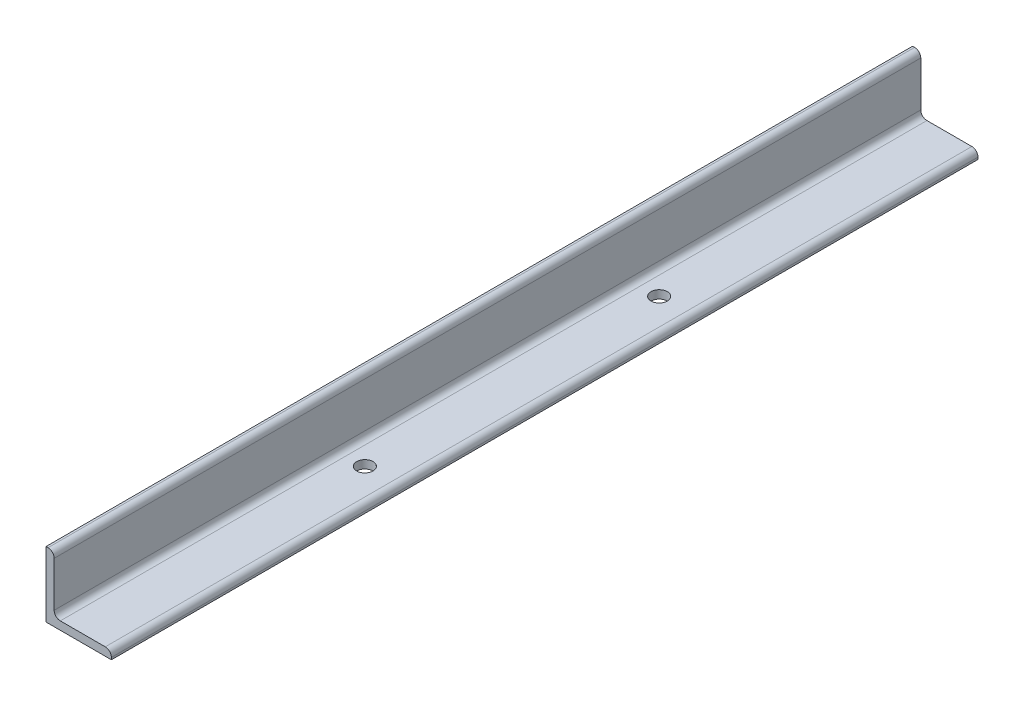
ISO-10303-21;
HEADER;
FILE_DESCRIPTION(('STEP AP214'),'2;1');
FILE_NAME('part.step','',(''),(''),'','','');
FILE_SCHEMA(('AUTOMOTIVE_DESIGN { 1 0 10303 214 1 1 1 1 }'));
ENDSEC;
DATA;
#1=APPLICATION_CONTEXT('core data for automotive mechanical design processes');
#2=APPLICATION_PROTOCOL_DEFINITION('international standard','automotive_design',2000,#1);
#3=PRODUCT_CONTEXT('',#1,'mechanical');
#4=PRODUCT('Part','Part','',(#3));
#5=PRODUCT_RELATED_PRODUCT_CATEGORY('part','',(#4));
#6=PRODUCT_DEFINITION_FORMATION('','',#4);
#7=PRODUCT_DEFINITION_CONTEXT('part definition',#1,'design');
#8=PRODUCT_DEFINITION('design','',#6,#7);
#9=PRODUCT_DEFINITION_SHAPE('','',#8);
#10=(LENGTH_UNIT() NAMED_UNIT(*) SI_UNIT(.MILLI.,.METRE.));
#11=(NAMED_UNIT(*) PLANE_ANGLE_UNIT() SI_UNIT($,.RADIAN.));
#12=(NAMED_UNIT(*) SI_UNIT($,.STERADIAN.) SOLID_ANGLE_UNIT());
#13=UNCERTAINTY_MEASURE_WITH_UNIT(LENGTH_MEASURE(1.E-05),#10,'distance_accuracy_value','');
#14=(GEOMETRIC_REPRESENTATION_CONTEXT(3) GLOBAL_UNCERTAINTY_ASSIGNED_CONTEXT((#13)) GLOBAL_UNIT_ASSIGNED_CONTEXT((#10,
#11,#12)) REPRESENTATION_CONTEXT('',''));
#15=CARTESIAN_POINT('',(0.,0.,0.));
#16=DIRECTION('',(0.,0.,1.));
#17=DIRECTION('',(1.,0.,0.));
#18=AXIS2_PLACEMENT_3D('',#15,#16,#17);
#19=CARTESIAN_POINT('',(50.7999999999999,0.,336.55));
#20=DIRECTION('',(0.,1.,0.));
#21=DIRECTION('',(0.,0.,1.));
#22=AXIS2_PLACEMENT_3D('',#19,#20,#21);
#23=PLANE('',#22);
#24=CARTESIAN_POINT('',(25.4,0.,114.3));
#25=DIRECTION('',(0.,-1.,0.));
#26=DIRECTION('',(0.,0.,-1.));
#27=AXIS2_PLACEMENT_3D('',#24,#25,#26);
#28=CIRCLE('',#27,6.35);
#29=CARTESIAN_POINT('',(25.4,0.,107.95));
#30=VERTEX_POINT('',#29);
#31=EDGE_CURVE('E178',#30,#30,#28,.T.);
#32=ORIENTED_EDGE('',*,*,#31,.F.);
#33=EDGE_LOOP('',(#32));
#34=FACE_BOUND('',#33,.T.);
#35=CARTESIAN_POINT('',(25.4,0.,-114.3));
#36=DIRECTION('',(0.,-1.,0.));
#37=DIRECTION('',(0.,0.,-1.));
#38=AXIS2_PLACEMENT_3D('',#35,#36,#37);
#39=CIRCLE('',#38,6.35);
#40=CARTESIAN_POINT('',(25.4,0.,-120.65));
#41=VERTEX_POINT('',#40);
#42=EDGE_CURVE('E170',#41,#41,#39,.T.);
#43=ORIENTED_EDGE('',*,*,#42,.F.);
#44=EDGE_LOOP('',(#43));
#45=FACE_BOUND('',#44,.T.);
#46=DIRECTION('',(1.,0.,0.));
#47=VECTOR('',#46,1.);
#48=CARTESIAN_POINT('',(50.7999999999999,0.,-336.55));
#49=LINE('',#48,#47);
#50=CARTESIAN_POINT('',(0.,0.,-336.55));
#51=VERTEX_POINT('',#50);
#52=CARTESIAN_POINT('',(50.7999999999999,0.,-336.55));
#53=VERTEX_POINT('',#52);
#54=EDGE_CURVE('E138',#51,#53,#49,.T.);
#55=ORIENTED_EDGE('',*,*,#54,.T.);
#56=DIRECTION('',(0.,0.,-1.));
#57=VECTOR('',#56,1.);
#58=CARTESIAN_POINT('',(50.7999999999999,0.,336.55));
#59=LINE('',#58,#57);
#60=CARTESIAN_POINT('',(50.7999999999999,0.,336.55));
#61=VERTEX_POINT('',#60);
#62=EDGE_CURVE('E11',#61,#53,#59,.T.);
#63=ORIENTED_EDGE('',*,*,#62,.F.);
#64=DIRECTION('',(1.,0.,0.));
#65=VECTOR('',#64,1.);
#66=CARTESIAN_POINT('',(50.7999999999999,0.,336.55));
#67=LINE('',#66,#65);
#68=CARTESIAN_POINT('',(0.,0.,336.55));
#69=VERTEX_POINT('',#68);
#70=EDGE_CURVE('E155',#69,#61,#67,.T.);
#71=ORIENTED_EDGE('',*,*,#70,.F.);
#72=DIRECTION('',(0.,0.,-1.));
#73=VECTOR('',#72,1.);
#74=CARTESIAN_POINT('',(0.,0.,336.55));
#75=LINE('',#74,#73);
#76=EDGE_CURVE('E134',#69,#51,#75,.T.);
#77=ORIENTED_EDGE('',*,*,#76,.T.);
#78=EDGE_LOOP('',(#55,#63,#71,#77));
#79=FACE_BOUND('',#78,.T.);
#80=ADVANCED_FACE('F34',(#34,#45,#79),#23,.F.);
#81=CARTESIAN_POINT('',(50.7999999999999,1.59258,336.55));
#82=DIRECTION('',(-1.,0.,0.));
#83=DIRECTION('',(0.,0.,1.));
#84=AXIS2_PLACEMENT_3D('',#81,#82,#83);
#85=PLANE('',#84);
#86=DIRECTION('',(0.,1.,0.));
#87=VECTOR('',#86,1.);
#88=CARTESIAN_POINT('',(50.7999999999999,1.59258,-336.55));
#89=LINE('',#88,#87);
#90=CARTESIAN_POINT('',(50.7999999999999,1.59258,-336.55));
#91=VERTEX_POINT('',#90);
#92=EDGE_CURVE('E141',#53,#91,#89,.T.);
#93=ORIENTED_EDGE('',*,*,#92,.T.);
#94=DIRECTION('',(0.,0.,-1.));
#95=VECTOR('',#94,1.);
#96=CARTESIAN_POINT('',(50.7999999999999,1.59258,336.55));
#97=LINE('',#96,#95);
#98=CARTESIAN_POINT('',(50.7999999999999,1.59258,336.55));
#99=VERTEX_POINT('',#98);
#100=EDGE_CURVE('E43',#99,#91,#97,.T.);
#101=ORIENTED_EDGE('',*,*,#100,.F.);
#102=DIRECTION('',(0.,1.,0.));
#103=VECTOR('',#102,1.);
#104=CARTESIAN_POINT('',(50.7999999999999,1.59258,336.55));
#105=LINE('',#104,#103);
#106=EDGE_CURVE('E98',#61,#99,#105,.T.);
#107=ORIENTED_EDGE('',*,*,#106,.F.);
#108=ORIENTED_EDGE('',*,*,#62,.T.);
#109=EDGE_LOOP('',(#93,#101,#107,#108));
#110=FACE_BOUND('',#109,.T.);
#111=ADVANCED_FACE('F216',(#110),#85,.F.);
#112=CARTESIAN_POINT('',(46.0425799999999,1.59258,336.55));
#113=DIRECTION('',(0.,0.,-1.));
#114=DIRECTION('',(-1.,0.,0.));
#115=AXIS2_PLACEMENT_3D('',#112,#113,#114);
#116=CYLINDRICAL_SURFACE('',#115,4.75742);
#117=CARTESIAN_POINT('',(46.0425799999999,1.59258,-336.55));
#118=DIRECTION('',(0.,0.,1.));
#119=DIRECTION('',(1.,0.,0.));
#120=AXIS2_PLACEMENT_3D('',#117,#118,#119);
#121=CIRCLE('',#120,4.75742);
#122=CARTESIAN_POINT('',(46.0425799999999,6.34999999999999,-336.55));
#123=VERTEX_POINT('',#122);
#124=EDGE_CURVE('E144',#91,#123,#121,.T.);
#125=ORIENTED_EDGE('',*,*,#124,.T.);
#126=DIRECTION('',(0.,0.,-1.));
#127=VECTOR('',#126,1.);
#128=CARTESIAN_POINT('',(46.0425799999999,6.34999999999999,336.55));
#129=LINE('',#128,#127);
#130=CARTESIAN_POINT('',(46.0425799999999,6.34999999999999,336.55));
#131=VERTEX_POINT('',#130);
#132=EDGE_CURVE('E165',#131,#123,#129,.T.);
#133=ORIENTED_EDGE('',*,*,#132,.F.);
#134=CARTESIAN_POINT('',(46.0425799999999,1.59258,336.55));
#135=DIRECTION('',(0.,0.,1.));
#136=DIRECTION('',(1.,0.,0.));
#137=AXIS2_PLACEMENT_3D('',#134,#135,#136);
#138=CIRCLE('',#137,4.75742);
#139=EDGE_CURVE('E183',#99,#131,#138,.T.);
#140=ORIENTED_EDGE('',*,*,#139,.F.);
#141=ORIENTED_EDGE('',*,*,#100,.T.);
#142=EDGE_LOOP('',(#125,#133,#140,#141));
#143=FACE_BOUND('',#142,.T.);
#144=ADVANCED_FACE('F223',(#143),#116,.T.);
#145=CARTESIAN_POINT('',(11.1125,6.34999999999999,336.55));
#146=DIRECTION('',(0.,-1.,0.));
#147=DIRECTION('',(0.,0.,-1.));
#148=AXIS2_PLACEMENT_3D('',#145,#146,#147);
#149=PLANE('',#148);
#150=CARTESIAN_POINT('',(25.4,6.34999999999999,114.3));
#151=DIRECTION('',(0.,-1.,0.));
#152=DIRECTION('',(0.,0.,-1.));
#153=AXIS2_PLACEMENT_3D('',#150,#151,#152);
#154=CIRCLE('',#153,6.35);
#155=CARTESIAN_POINT('',(25.4,6.34999999999999,107.95));
#156=VERTEX_POINT('',#155);
#157=EDGE_CURVE('E37',#156,#156,#154,.T.);
#158=ORIENTED_EDGE('',*,*,#157,.T.);
#159=EDGE_LOOP('',(#158));
#160=FACE_BOUND('',#159,.T.);
#161=CARTESIAN_POINT('',(25.4,6.34999999999999,-114.3));
#162=DIRECTION('',(0.,-1.,0.));
#163=DIRECTION('',(0.,0.,-1.));
#164=AXIS2_PLACEMENT_3D('',#161,#162,#163);
#165=CIRCLE('',#164,6.35);
#166=CARTESIAN_POINT('',(25.4,6.34999999999999,-120.65));
#167=VERTEX_POINT('',#166);
#168=EDGE_CURVE('E142',#167,#167,#165,.T.);
#169=ORIENTED_EDGE('',*,*,#168,.T.);
#170=EDGE_LOOP('',(#169));
#171=FACE_BOUND('',#170,.T.);
#172=DIRECTION('',(-1.,0.,0.));
#173=VECTOR('',#172,1.);
#174=CARTESIAN_POINT('',(11.1125,6.34999999999999,-336.55));
#175=LINE('',#174,#173);
#176=CARTESIAN_POINT('',(11.1125,6.34999999999999,-336.55));
#177=VERTEX_POINT('',#176);
#178=EDGE_CURVE('E146',#123,#177,#175,.T.);
#179=ORIENTED_EDGE('',*,*,#178,.T.);
#180=DIRECTION('',(0.,0.,-1.));
#181=VECTOR('',#180,1.);
#182=CARTESIAN_POINT('',(11.1125,6.34999999999999,336.55));
#183=LINE('',#182,#181);
#184=CARTESIAN_POINT('',(11.1125,6.34999999999999,336.55));
#185=VERTEX_POINT('',#184);
#186=EDGE_CURVE('E162',#185,#177,#183,.T.);
#187=ORIENTED_EDGE('',*,*,#186,.F.);
#188=DIRECTION('',(-1.,0.,0.));
#189=VECTOR('',#188,1.);
#190=CARTESIAN_POINT('',(11.1125,6.34999999999999,336.55));
#191=LINE('',#190,#189);
#192=EDGE_CURVE('E185',#131,#185,#191,.T.);
#193=ORIENTED_EDGE('',*,*,#192,.F.);
#194=ORIENTED_EDGE('',*,*,#132,.T.);
#195=EDGE_LOOP('',(#179,#187,#193,#194));
#196=FACE_BOUND('',#195,.T.);
#197=ADVANCED_FACE('F235',(#160,#171,#196),#149,.F.);
#198=CARTESIAN_POINT('',(11.1125,11.1125,336.55));
#199=DIRECTION('',(0.,0.,-1.));
#200=DIRECTION('',(-1.,0.,0.));
#201=AXIS2_PLACEMENT_3D('',#198,#199,#200);
#202=CYLINDRICAL_SURFACE('',#201,4.7625);
#203=CARTESIAN_POINT('',(11.1125,11.1125,-336.55));
#204=DIRECTION('',(0.,0.,-1.));
#205=DIRECTION('',(-1.,0.,0.));
#206=AXIS2_PLACEMENT_3D('',#203,#204,#205);
#207=CIRCLE('',#206,4.7625);
#208=CARTESIAN_POINT('',(6.35,11.1125,-336.55));
#209=VERTEX_POINT('',#208);
#210=EDGE_CURVE('E148',#177,#209,#207,.T.);
#211=ORIENTED_EDGE('',*,*,#210,.T.);
#212=DIRECTION('',(0.,0.,-1.));
#213=VECTOR('',#212,1.);
#214=CARTESIAN_POINT('',(6.35,11.1125,336.55));
#215=LINE('',#214,#213);
#216=CARTESIAN_POINT('',(6.35,11.1125,336.55));
#217=VERTEX_POINT('',#216);
#218=EDGE_CURVE('E159',#217,#209,#215,.T.);
#219=ORIENTED_EDGE('',*,*,#218,.F.);
#220=CARTESIAN_POINT('',(11.1125,11.1125,336.55));
#221=DIRECTION('',(0.,0.,-1.));
#222=DIRECTION('',(-1.,0.,0.));
#223=AXIS2_PLACEMENT_3D('',#220,#221,#222);
#224=CIRCLE('',#223,4.7625);
#225=EDGE_CURVE('E187',#185,#217,#224,.T.);
#226=ORIENTED_EDGE('',*,*,#225,.F.);
#227=ORIENTED_EDGE('',*,*,#186,.T.);
#228=EDGE_LOOP('',(#211,#219,#226,#227));
#229=FACE_BOUND('',#228,.T.);
#230=ADVANCED_FACE('F193',(#229),#202,.F.);
#231=CARTESIAN_POINT('',(6.35,46.04258,336.55));
#232=DIRECTION('',(-1.,0.,0.));
#233=DIRECTION('',(0.,-1.,0.));
#234=AXIS2_PLACEMENT_3D('',#231,#232,#233);
#235=PLANE('',#234);
#236=DIRECTION('',(0.,1.,0.));
#237=VECTOR('',#236,1.);
#238=CARTESIAN_POINT('',(6.35,46.04258,-336.55));
#239=LINE('',#238,#237);
#240=CARTESIAN_POINT('',(6.35,46.04258,-336.55));
#241=VERTEX_POINT('',#240);
#242=EDGE_CURVE('E150',#209,#241,#239,.T.);
#243=ORIENTED_EDGE('',*,*,#242,.T.);
#244=DIRECTION('',(0.,0.,-1.));
#245=VECTOR('',#244,1.);
#246=CARTESIAN_POINT('',(6.35,46.04258,336.55));
#247=LINE('',#246,#245);
#248=CARTESIAN_POINT('',(6.35,46.04258,336.55));
#249=VERTEX_POINT('',#248);
#250=EDGE_CURVE('E129',#249,#241,#247,.T.);
#251=ORIENTED_EDGE('',*,*,#250,.F.);
#252=DIRECTION('',(0.,1.,0.));
#253=VECTOR('',#252,1.);
#254=CARTESIAN_POINT('',(6.35,46.04258,336.55));
#255=LINE('',#254,#253);
#256=EDGE_CURVE('E120',#217,#249,#255,.T.);
#257=ORIENTED_EDGE('',*,*,#256,.F.);
#258=ORIENTED_EDGE('',*,*,#218,.T.);
#259=EDGE_LOOP('',(#243,#251,#257,#258));
#260=FACE_BOUND('',#259,.T.);
#261=ADVANCED_FACE('F197',(#260),#235,.F.);
#262=CARTESIAN_POINT('',(1.59258,46.04258,336.55));
#263=DIRECTION('',(0.,0.,-1.));
#264=DIRECTION('',(-1.,0.,0.));
#265=AXIS2_PLACEMENT_3D('',#262,#263,#264);
#266=CYLINDRICAL_SURFACE('',#265,4.75742);
#267=CARTESIAN_POINT('',(1.59258,46.04258,-336.55));
#268=DIRECTION('',(0.,0.,1.));
#269=DIRECTION('',(-1.,0.,0.));
#270=AXIS2_PLACEMENT_3D('',#267,#268,#269);
#271=CIRCLE('',#270,4.75742);
#272=CARTESIAN_POINT('',(1.59258,50.8,-336.55));
#273=VERTEX_POINT('',#272);
#274=EDGE_CURVE('E128',#241,#273,#271,.T.);
#275=ORIENTED_EDGE('',*,*,#274,.T.);
#276=DIRECTION('',(0.,0.,-1.));
#277=VECTOR('',#276,1.);
#278=CARTESIAN_POINT('',(1.59258,50.8,336.55));
#279=LINE('',#278,#277);
#280=CARTESIAN_POINT('',(1.59258,50.8,336.55));
#281=VERTEX_POINT('',#280);
#282=EDGE_CURVE('E125',#281,#273,#279,.T.);
#283=ORIENTED_EDGE('',*,*,#282,.F.);
#284=CARTESIAN_POINT('',(1.59258,46.04258,336.55));
#285=DIRECTION('',(0.,0.,1.));
#286=DIRECTION('',(-1.,0.,0.));
#287=AXIS2_PLACEMENT_3D('',#284,#285,#286);
#288=CIRCLE('',#287,4.75742);
#289=EDGE_CURVE('E114',#249,#281,#288,.T.);
#290=ORIENTED_EDGE('',*,*,#289,.F.);
#291=ORIENTED_EDGE('',*,*,#250,.T.);
#292=EDGE_LOOP('',(#275,#283,#290,#291));
#293=FACE_BOUND('',#292,.T.);
#294=ADVANCED_FACE('F126',(#293),#266,.T.);
#295=CARTESIAN_POINT('',(0.,50.8,336.55));
#296=DIRECTION('',(0.,-1.,0.));
#297=DIRECTION('',(0.,0.,-1.));
#298=AXIS2_PLACEMENT_3D('',#295,#296,#297);
#299=PLANE('',#298);
#300=DIRECTION('',(-1.,0.,0.));
#301=VECTOR('',#300,1.);
#302=CARTESIAN_POINT('',(0.,50.8,-336.55));
#303=LINE('',#302,#301);
#304=CARTESIAN_POINT('',(0.,50.8,-336.55));
#305=VERTEX_POINT('',#304);
#306=EDGE_CURVE('E84',#273,#305,#303,.T.);
#307=ORIENTED_EDGE('',*,*,#306,.T.);
#308=DIRECTION('',(0.,0.,-1.));
#309=VECTOR('',#308,1.);
#310=CARTESIAN_POINT('',(0.,50.8,336.55));
#311=LINE('',#310,#309);
#312=CARTESIAN_POINT('',(0.,50.8,336.55));
#313=VERTEX_POINT('',#312);
#314=EDGE_CURVE('E130',#313,#305,#311,.T.);
#315=ORIENTED_EDGE('',*,*,#314,.F.);
#316=DIRECTION('',(-1.,0.,0.));
#317=VECTOR('',#316,1.);
#318=CARTESIAN_POINT('',(0.,50.8,336.55));
#319=LINE('',#318,#317);
#320=EDGE_CURVE('E118',#281,#313,#319,.T.);
#321=ORIENTED_EDGE('',*,*,#320,.F.);
#322=ORIENTED_EDGE('',*,*,#282,.T.);
#323=EDGE_LOOP('',(#307,#315,#321,#322));
#324=FACE_BOUND('',#323,.T.);
#325=ADVANCED_FACE('F132',(#324),#299,.F.);
#326=CARTESIAN_POINT('',(0.,0.,336.55));
#327=DIRECTION('',(1.,0.,0.));
#328=DIRECTION('',(0.,1.,0.));
#329=AXIS2_PLACEMENT_3D('',#326,#327,#328);
#330=PLANE('',#329);
#331=DIRECTION('',(0.,-1.,0.));
#332=VECTOR('',#331,1.);
#333=CARTESIAN_POINT('',(0.,0.,-336.55));
#334=LINE('',#333,#332);
#335=EDGE_CURVE('E90',#305,#51,#334,.T.);
#336=ORIENTED_EDGE('',*,*,#335,.T.);
#337=ORIENTED_EDGE('',*,*,#76,.F.);
#338=DIRECTION('',(0.,-1.,0.));
#339=VECTOR('',#338,1.);
#340=CARTESIAN_POINT('',(0.,0.,336.55));
#341=LINE('',#340,#339);
#342=EDGE_CURVE('E52',#313,#69,#341,.T.);
#343=ORIENTED_EDGE('',*,*,#342,.F.);
#344=ORIENTED_EDGE('',*,*,#314,.T.);
#345=EDGE_LOOP('',(#336,#337,#343,#344));
#346=FACE_BOUND('',#345,.T.);
#347=ADVANCED_FACE('F205',(#346),#330,.F.);
#348=CARTESIAN_POINT('',(1.59258,46.04258,336.55));
#349=DIRECTION('',(0.,0.,-1.));
#350=DIRECTION('',(-1.,0.,0.));
#351=AXIS2_PLACEMENT_3D('',#348,#349,#350);
#352=PLANE('',#351);
#353=ORIENTED_EDGE('',*,*,#70,.T.);
#354=ORIENTED_EDGE('',*,*,#106,.T.);
#355=ORIENTED_EDGE('',*,*,#139,.T.);
#356=ORIENTED_EDGE('',*,*,#192,.T.);
#357=ORIENTED_EDGE('',*,*,#225,.T.);
#358=ORIENTED_EDGE('',*,*,#256,.T.);
#359=ORIENTED_EDGE('',*,*,#289,.T.);
#360=ORIENTED_EDGE('',*,*,#320,.T.);
#361=ORIENTED_EDGE('',*,*,#342,.T.);
#362=EDGE_LOOP('',(#353,#354,#355,#356,#357,#358,#359,#360,#361));
#363=FACE_BOUND('',#362,.T.);
#364=ADVANCED_FACE('F116',(#363),#352,.F.);
#365=CARTESIAN_POINT('',(1.59258,46.04258,-336.55));
#366=DIRECTION('',(0.,0.,-1.));
#367=DIRECTION('',(-1.,0.,0.));
#368=AXIS2_PLACEMENT_3D('',#365,#366,#367);
#369=PLANE('',#368);
#370=ORIENTED_EDGE('',*,*,#54,.F.);
#371=ORIENTED_EDGE('',*,*,#335,.F.);
#372=ORIENTED_EDGE('',*,*,#306,.F.);
#373=ORIENTED_EDGE('',*,*,#274,.F.);
#374=ORIENTED_EDGE('',*,*,#242,.F.);
#375=ORIENTED_EDGE('',*,*,#210,.F.);
#376=ORIENTED_EDGE('',*,*,#178,.F.);
#377=ORIENTED_EDGE('',*,*,#124,.F.);
#378=ORIENTED_EDGE('',*,*,#92,.F.);
#379=EDGE_LOOP('',(#370,#371,#372,#373,#374,#375,#376,#377,#378));
#380=FACE_BOUND('',#379,.T.);
#381=ADVANCED_FACE('F200',(#380),#369,.T.);
#382=CARTESIAN_POINT('',(25.4,50.8,-114.3));
#383=DIRECTION('',(0.,-1.,0.));
#384=DIRECTION('',(0.,0.,-1.));
#385=AXIS2_PLACEMENT_3D('',#382,#383,#384);
#386=CYLINDRICAL_SURFACE('',#385,6.35);
#387=ORIENTED_EDGE('',*,*,#42,.T.);
#388=EDGE_LOOP('',(#387));
#389=FACE_BOUND('',#388,.T.);
#390=ORIENTED_EDGE('',*,*,#168,.F.);
#391=EDGE_LOOP('',(#390));
#392=FACE_BOUND('',#391,.T.);
#393=ADVANCED_FACE('F231',(#389,#392),#386,.F.);
#394=CARTESIAN_POINT('',(25.4,50.8,114.3));
#395=DIRECTION('',(0.,-1.,0.));
#396=DIRECTION('',(0.,0.,-1.));
#397=AXIS2_PLACEMENT_3D('',#394,#395,#396);
#398=CYLINDRICAL_SURFACE('',#397,6.35);
#399=ORIENTED_EDGE('',*,*,#31,.T.);
#400=EDGE_LOOP('',(#399));
#401=FACE_BOUND('',#400,.T.);
#402=ORIENTED_EDGE('',*,*,#157,.F.);
#403=EDGE_LOOP('',(#402));
#404=FACE_BOUND('',#403,.T.);
#405=ADVANCED_FACE('F228',(#401,#404),#398,.F.);
#406=CLOSED_SHELL('',(#80,#111,#144,#197,#230,#261,#294,#325,#347,#364,#381,#393,#405));
#407=MANIFOLD_SOLID_BREP('B2',#406);
#408=ADVANCED_BREP_SHAPE_REPRESENTATION('',(#18,#407),#14);
#409=SHAPE_DEFINITION_REPRESENTATION(#9,#408);
ENDSEC;
END-ISO-10303-21;
